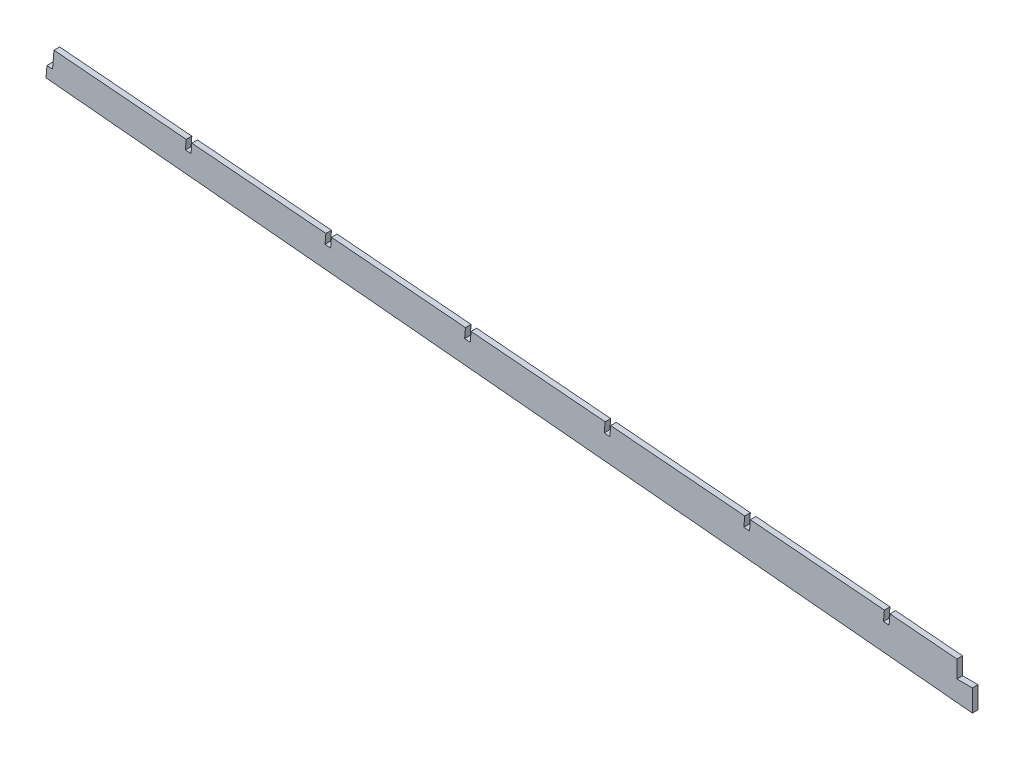
ISO-10303-21;
HEADER;
FILE_DESCRIPTION(('STEP AP214'),'2;1');
FILE_NAME('part.step','',(''),(''),'','','');
FILE_SCHEMA(('AUTOMOTIVE_DESIGN { 1 0 10303 214 1 1 1 1 }'));
ENDSEC;
DATA;
#1=APPLICATION_CONTEXT('core data for automotive mechanical design processes');
#2=APPLICATION_PROTOCOL_DEFINITION('international standard','automotive_design',2000,#1);
#3=PRODUCT_CONTEXT('',#1,'mechanical');
#4=PRODUCT('Part','Part','',(#3));
#5=PRODUCT_RELATED_PRODUCT_CATEGORY('part','',(#4));
#6=PRODUCT_DEFINITION_FORMATION('','',#4);
#7=PRODUCT_DEFINITION_CONTEXT('part definition',#1,'design');
#8=PRODUCT_DEFINITION('design','',#6,#7);
#9=PRODUCT_DEFINITION_SHAPE('','',#8);
#10=(LENGTH_UNIT() NAMED_UNIT(*) SI_UNIT(.MILLI.,.METRE.));
#11=(NAMED_UNIT(*) PLANE_ANGLE_UNIT() SI_UNIT($,.RADIAN.));
#12=(NAMED_UNIT(*) SI_UNIT($,.STERADIAN.) SOLID_ANGLE_UNIT());
#13=UNCERTAINTY_MEASURE_WITH_UNIT(LENGTH_MEASURE(1.E-05),#10,'distance_accuracy_value','');
#14=(GEOMETRIC_REPRESENTATION_CONTEXT(3) GLOBAL_UNCERTAINTY_ASSIGNED_CONTEXT((#13)) GLOBAL_UNIT_ASSIGNED_CONTEXT((#10,
#11,#12)) REPRESENTATION_CONTEXT('',''));
#15=CARTESIAN_POINT('',(0.,0.,0.));
#16=DIRECTION('',(0.,0.,1.));
#17=DIRECTION('',(1.,0.,0.));
#18=AXIS2_PLACEMENT_3D('',#15,#16,#17);
#19=CARTESIAN_POINT('',(-0.0318534873323505,-0.379333063626216,3.175));
#20=DIRECTION('',(-0.0836778433323156,-0.996492859249504,0.));
#21=DIRECTION('',(0.996492859249504,-0.0836778433323156,0.));
#22=AXIS2_PLACEMENT_3D('',#19,#20,#21);
#23=PLANE('',#22);
#24=DIRECTION('',(0.,0.,1.));
#25=VECTOR('',#24,1.);
#26=CARTESIAN_POINT('',(-435.836990415104,36.2162467569108,-4.445));
#27=LINE('',#26,#25);
#28=CARTESIAN_POINT('',(-435.836990415104,36.2162467569108,0.));
#29=VERTEX_POINT('',#28);
#30=CARTESIAN_POINT('',(-435.836990415104,36.2162467569108,3.175));
#31=VERTEX_POINT('',#30);
#32=EDGE_CURVE('E282',#29,#31,#27,.T.);
#33=ORIENTED_EDGE('',*,*,#32,.F.);
#34=DIRECTION('',(-0.996492859249504,0.0836778433323156,0.));
#35=VECTOR('',#34,1.);
#36=CARTESIAN_POINT('',(-0.0318534873323505,-0.379333063626216,0.));
#37=LINE('',#36,#35);
#38=CARTESIAN_POINT('',(-473.740091055947,39.3990590448204,0.));
#39=VERTEX_POINT('',#38);
#40=EDGE_CURVE('E530',#29,#39,#37,.T.);
#41=ORIENTED_EDGE('',*,*,#40,.T.);
#42=DIRECTION('',(0.,0.,1.));
#43=VECTOR('',#42,1.);
#44=CARTESIAN_POINT('',(-473.740091055947,39.3990590448204,0.));
#45=LINE('',#44,#43);
#46=CARTESIAN_POINT('',(-473.740091055947,39.3990590448204,3.175));
#47=VERTEX_POINT('',#46);
#48=EDGE_CURVE('E492',#39,#47,#45,.T.);
#49=ORIENTED_EDGE('',*,*,#48,.T.);
#50=DIRECTION('',(-0.996492859249504,0.0836778433323156,0.));
#51=VECTOR('',#50,1.);
#52=CARTESIAN_POINT('',(-0.0318534873323505,-0.379333063626216,3.175));
#53=LINE('',#52,#51);
#54=EDGE_CURVE('E510',#31,#47,#53,.T.);
#55=ORIENTED_EDGE('',*,*,#54,.F.);
#56=EDGE_LOOP('',(#33,#41,#49,#55));
#57=FACE_BOUND('',#56,.T.);
#58=ADVANCED_FACE('F44',(#57),#23,.F.);
#59=DIRECTION('',(0.,0.,1.));
#60=VECTOR('',#59,1.);
#61=CARTESIAN_POINT('',(-868.590421604971,72.5555676868171,0.));
#62=LINE('',#61,#60);
#63=CARTESIAN_POINT('',(-868.590421604971,72.5555676868171,0.));
#64=VERTEX_POINT('',#63);
#65=CARTESIAN_POINT('',(-868.590421604971,72.5555676868171,3.175));
#66=VERTEX_POINT('',#65);
#67=EDGE_CURVE('E313',#64,#66,#62,.T.);
#68=ORIENTED_EDGE('',*,*,#67,.T.);
#69=CARTESIAN_POINT('',(-792.784220323284,66.1899431109979,3.175));
#70=VERTEX_POINT('',#69);
#71=EDGE_CURVE('E599',#70,#66,#53,.T.);
#72=ORIENTED_EDGE('',*,*,#71,.F.);
#73=DIRECTION('',(0.,0.,1.));
#74=VECTOR('',#73,1.);
#75=CARTESIAN_POINT('',(-792.784220323284,66.1899431109979,0.));
#76=LINE('',#75,#74);
#77=CARTESIAN_POINT('',(-792.784220323284,66.1899431109979,0.));
#78=VERTEX_POINT('',#77);
#79=EDGE_CURVE('E351',#78,#70,#76,.T.);
#80=ORIENTED_EDGE('',*,*,#79,.F.);
#81=EDGE_CURVE('E633',#78,#64,#37,.T.);
#82=ORIENTED_EDGE('',*,*,#81,.T.);
#83=EDGE_LOOP('',(#68,#72,#80,#82));
#84=FACE_BOUND('',#83,.T.);
#85=ADVANCED_FACE('F710',(#84),#23,.F.);
#86=DIRECTION('',(0.,0.,1.));
#87=VECTOR('',#86,1.);
#88=CARTESIAN_POINT('',(-789.620355495167,65.9242659584178,0.));
#89=LINE('',#88,#87);
#90=CARTESIAN_POINT('',(-789.620355495167,65.9242659584178,0.));
#91=VERTEX_POINT('',#90);
#92=CARTESIAN_POINT('',(-789.620355495167,65.9242659584178,3.175));
#93=VERTEX_POINT('',#92);
#94=EDGE_CURVE('E354',#91,#93,#89,.T.);
#95=ORIENTED_EDGE('',*,*,#94,.T.);
#96=CARTESIAN_POINT('',(-713.814154213479,59.5586413825986,3.175));
#97=VERTEX_POINT('',#96);
#98=EDGE_CURVE('E593',#97,#93,#53,.T.);
#99=ORIENTED_EDGE('',*,*,#98,.F.);
#100=DIRECTION('',(0.,0.,1.));
#101=VECTOR('',#100,1.);
#102=CARTESIAN_POINT('',(-713.814154213479,59.5586413825986,0.));
#103=LINE('',#102,#101);
#104=CARTESIAN_POINT('',(-713.814154213479,59.5586413825986,0.));
#105=VERTEX_POINT('',#104);
#106=EDGE_CURVE('E386',#105,#97,#103,.T.);
#107=ORIENTED_EDGE('',*,*,#106,.F.);
#108=EDGE_CURVE('E637',#105,#91,#37,.T.);
#109=ORIENTED_EDGE('',*,*,#108,.T.);
#110=EDGE_LOOP('',(#95,#99,#107,#109));
#111=FACE_BOUND('',#110,.T.);
#112=ADVANCED_FACE('F698',(#111),#23,.F.);
#113=DIRECTION('',(0.,0.,1.));
#114=VECTOR('',#113,1.);
#115=CARTESIAN_POINT('',(-710.650289385362,59.2929642300185,0.));
#116=LINE('',#115,#114);
#117=CARTESIAN_POINT('',(-710.650289385362,59.2929642300185,0.));
#118=VERTEX_POINT('',#117);
#119=CARTESIAN_POINT('',(-710.650289385362,59.2929642300185,3.175));
#120=VERTEX_POINT('',#119);
#121=EDGE_CURVE('E389',#118,#120,#116,.T.);
#122=ORIENTED_EDGE('',*,*,#121,.T.);
#123=CARTESIAN_POINT('',(-634.844088103674,52.9273396541992,3.175));
#124=VERTEX_POINT('',#123);
#125=EDGE_CURVE('E587',#124,#120,#53,.T.);
#126=ORIENTED_EDGE('',*,*,#125,.F.);
#127=DIRECTION('',(0.,0.,1.));
#128=VECTOR('',#127,1.);
#129=CARTESIAN_POINT('',(-634.844088103674,52.9273396541992,0.));
#130=LINE('',#129,#128);
#131=CARTESIAN_POINT('',(-634.844088103674,52.9273396541992,0.));
#132=VERTEX_POINT('',#131);
#133=EDGE_CURVE('E421',#132,#124,#130,.T.);
#134=ORIENTED_EDGE('',*,*,#133,.F.);
#135=EDGE_CURVE('E644',#132,#118,#37,.T.);
#136=ORIENTED_EDGE('',*,*,#135,.T.);
#137=EDGE_LOOP('',(#122,#126,#134,#136));
#138=FACE_BOUND('',#137,.T.);
#139=ADVANCED_FACE('F686',(#138),#23,.F.);
#140=DIRECTION('',(0.,0.,1.));
#141=VECTOR('',#140,1.);
#142=CARTESIAN_POINT('',(-631.680223275557,52.6616625016191,0.));
#143=LINE('',#142,#141);
#144=CARTESIAN_POINT('',(-631.680223275557,52.6616625016191,0.));
#145=VERTEX_POINT('',#144);
#146=CARTESIAN_POINT('',(-631.680223275557,52.6616625016191,3.175));
#147=VERTEX_POINT('',#146);
#148=EDGE_CURVE('E424',#145,#147,#143,.T.);
#149=ORIENTED_EDGE('',*,*,#148,.T.);
#150=CARTESIAN_POINT('',(-555.874021993869,46.2960379257999,3.175));
#151=VERTEX_POINT('',#150);
#152=EDGE_CURVE('E583',#151,#147,#53,.T.);
#153=ORIENTED_EDGE('',*,*,#152,.F.);
#154=DIRECTION('',(0.,0.,1.));
#155=VECTOR('',#154,1.);
#156=CARTESIAN_POINT('',(-555.874021993869,46.2960379257999,0.));
#157=LINE('',#156,#155);
#158=CARTESIAN_POINT('',(-555.874021993869,46.2960379257999,0.));
#159=VERTEX_POINT('',#158);
#160=EDGE_CURVE('E456',#159,#151,#157,.T.);
#161=ORIENTED_EDGE('',*,*,#160,.F.);
#162=EDGE_CURVE('E651',#159,#145,#37,.T.);
#163=ORIENTED_EDGE('',*,*,#162,.T.);
#164=EDGE_LOOP('',(#149,#153,#161,#163));
#165=FACE_BOUND('',#164,.T.);
#166=ADVANCED_FACE('F674',(#165),#23,.F.);
#167=DIRECTION('',(0.,0.,1.));
#168=VECTOR('',#167,1.);
#169=CARTESIAN_POINT('',(-552.710157165752,46.0303607732198,0.));
#170=LINE('',#169,#168);
#171=CARTESIAN_POINT('',(-552.710157165752,46.0303607732198,0.));
#172=VERTEX_POINT('',#171);
#173=CARTESIAN_POINT('',(-552.710157165752,46.0303607732198,3.175));
#174=VERTEX_POINT('',#173);
#175=EDGE_CURVE('E459',#172,#174,#170,.T.);
#176=ORIENTED_EDGE('',*,*,#175,.T.);
#177=CARTESIAN_POINT('',(-476.903955884065,39.6647361974005,3.175));
#178=VERTEX_POINT('',#177);
#179=EDGE_CURVE('E514',#178,#174,#53,.T.);
#180=ORIENTED_EDGE('',*,*,#179,.F.);
#181=DIRECTION('',(0.,0.,1.));
#182=VECTOR('',#181,1.);
#183=CARTESIAN_POINT('',(-476.903955884065,39.6647361974005,0.));
#184=LINE('',#183,#182);
#185=CARTESIAN_POINT('',(-476.903955884065,39.6647361974005,0.));
#186=VERTEX_POINT('',#185);
#187=EDGE_CURVE('E489',#186,#178,#184,.T.);
#188=ORIENTED_EDGE('',*,*,#187,.F.);
#189=EDGE_CURVE('E533',#186,#172,#37,.T.);
#190=ORIENTED_EDGE('',*,*,#189,.T.);
#191=EDGE_LOOP('',(#176,#180,#188,#190));
#192=FACE_BOUND('',#191,.T.);
#193=ADVANCED_FACE('F579',(#192),#23,.F.);
#194=CARTESIAN_POINT('',(0.,0.,3.175));
#195=DIRECTION('',(0.,0.,1.));
#196=DIRECTION('',(1.,0.,0.));
#197=AXIS2_PLACEMENT_3D('',#194,#195,#196);
#198=PLANE('',#197);
#199=DIRECTION('',(0.,-1.,0.));
#200=VECTOR('',#199,1.);
#201=CARTESIAN_POINT('',(-427.115588921084,26.4516197265587,3.175));
#202=LINE('',#201,#200);
#203=CARTESIAN_POINT('',(-427.115588921084,26.4516197265587,3.175));
#204=VERTEX_POINT('',#203);
#205=CARTESIAN_POINT('',(-427.115588921078,14.108196168973,3.175));
#206=VERTEX_POINT('',#205);
#207=EDGE_CURVE('E60',#204,#206,#202,.T.);
#208=ORIENTED_EDGE('',*,*,#207,.F.);
#209=DIRECTION('',(1.,0.,0.));
#210=VECTOR('',#209,1.);
#211=CARTESIAN_POINT('',(-435.836990415104,26.4516197265587,3.175));
#212=LINE('',#211,#210);
#213=CARTESIAN_POINT('',(-435.836990415104,26.4516197265587,3.175));
#214=VERTEX_POINT('',#213);
#215=EDGE_CURVE('E262',#214,#204,#212,.T.);
#216=ORIENTED_EDGE('',*,*,#215,.F.);
#217=DIRECTION('',(0.,-1.,0.));
#218=VECTOR('',#217,1.);
#219=CARTESIAN_POINT('',(-435.836990415104,36.2162467569108,3.175));
#220=LINE('',#219,#218);
#221=EDGE_CURVE('E269',#31,#214,#220,.T.);
#222=ORIENTED_EDGE('',*,*,#221,.F.);
#223=ORIENTED_EDGE('',*,*,#54,.T.);
#224=DIRECTION('',(-0.0836778433323161,-0.996492859249504,0.));
#225=VECTOR('',#224,1.);
#226=CARTESIAN_POINT('',(-473.708237568615,39.7783921084469,3.175));
#227=LINE('',#226,#225);
#228=CARTESIAN_POINT('',(-474.231125379992,33.5514872376235,3.175));
#229=VERTEX_POINT('',#228);
#230=EDGE_CURVE('E480',#47,#229,#227,.T.);
#231=ORIENTED_EDGE('',*,*,#230,.T.);
#232=DIRECTION('',(-0.996405796065059,0.0847082615094664,0.));
#233=VECTOR('',#232,1.);
#234=CARTESIAN_POINT('',(-0.570967382438097,-6.71617147002641,3.175));
#235=LINE('',#234,#233);
#236=CARTESIAN_POINT('',(-477.394715473978,33.8204361117152,3.175));
#237=VERTEX_POINT('',#236);
#238=EDGE_CURVE('E289',#229,#237,#235,.T.);
#239=ORIENTED_EDGE('',*,*,#238,.T.);
#240=DIRECTION('',(-0.0836778433323169,-0.996492859249504,0.));
#241=VECTOR('',#240,1.);
#242=CARTESIAN_POINT('',(-476.872102396732,40.0440692610274,3.175));
#243=LINE('',#242,#241);
#244=EDGE_CURVE('E469',#178,#237,#243,.T.);
#245=ORIENTED_EDGE('',*,*,#244,.F.);
#246=ORIENTED_EDGE('',*,*,#179,.T.);
#247=DIRECTION('',(-0.0836778433323159,-0.996492859249504,0.));
#248=VECTOR('',#247,1.);
#249=CARTESIAN_POINT('',(-552.67830367842,46.4096938368461,3.175));
#250=LINE('',#249,#248);
#251=CARTESIAN_POINT('',(-553.194334125879,40.2644511349515,3.175));
#252=VERTEX_POINT('',#251);
#253=EDGE_CURVE('E446',#174,#252,#250,.T.);
#254=ORIENTED_EDGE('',*,*,#253,.T.);
#255=DIRECTION('',(-0.996405796065059,0.0847082615094664,0.));
#256=VECTOR('',#255,1.);
#257=CARTESIAN_POINT('',(-0.570967382438097,-6.71617147002641,3.175));
#258=LINE('',#257,#256);
#259=CARTESIAN_POINT('',(-556.357924219865,40.5334000090432,3.175));
#260=VERTEX_POINT('',#259);
#261=EDGE_CURVE('E442',#252,#260,#258,.T.);
#262=ORIENTED_EDGE('',*,*,#261,.T.);
#263=DIRECTION('',(-0.0836778433323176,-0.996492859249504,0.));
#264=VECTOR('',#263,1.);
#265=CARTESIAN_POINT('',(-555.842168506537,46.6753709894272,3.175));
#266=LINE('',#265,#264);
#267=EDGE_CURVE('E434',#151,#260,#266,.T.);
#268=ORIENTED_EDGE('',*,*,#267,.F.);
#269=ORIENTED_EDGE('',*,*,#152,.T.);
#270=DIRECTION('',(-0.0836778433323144,-0.996492859249504,0.));
#271=VECTOR('',#270,1.);
#272=CARTESIAN_POINT('',(-631.648369788225,53.0409955652446,3.175));
#273=LINE('',#272,#271);
#274=CARTESIAN_POINT('',(-632.157542871765,46.9774150322796,3.175));
#275=VERTEX_POINT('',#274);
#276=EDGE_CURVE('E411',#147,#275,#273,.T.);
#277=ORIENTED_EDGE('',*,*,#276,.T.);
#278=DIRECTION('',(-0.996405796065059,0.0847082615094664,0.));
#279=VECTOR('',#278,1.);
#280=CARTESIAN_POINT('',(-0.570967382438097,-6.71617147002641,3.175));
#281=LINE('',#280,#279);
#282=CARTESIAN_POINT('',(-635.321132965751,47.2463639063712,3.175));
#283=VERTEX_POINT('',#282);
#284=EDGE_CURVE('E407',#275,#283,#281,.T.);
#285=ORIENTED_EDGE('',*,*,#284,.T.);
#286=DIRECTION('',(-0.0836778433323144,-0.996492859249504,0.));
#287=VECTOR('',#286,1.);
#288=CARTESIAN_POINT('',(-634.812234616342,53.3066727178247,3.175));
#289=LINE('',#288,#287);
#290=EDGE_CURVE('E399',#124,#283,#289,.T.);
#291=ORIENTED_EDGE('',*,*,#290,.F.);
#292=ORIENTED_EDGE('',*,*,#125,.T.);
#293=DIRECTION('',(-0.0836778433323128,-0.996492859249505,0.));
#294=VECTOR('',#293,1.);
#295=CARTESIAN_POINT('',(-710.61843589803,59.6722972936427,3.175));
#296=LINE('',#295,#294);
#297=CARTESIAN_POINT('',(-711.120751617652,53.6903789296076,3.175));
#298=VERTEX_POINT('',#297);
#299=EDGE_CURVE('E376',#120,#298,#296,.T.);
#300=ORIENTED_EDGE('',*,*,#299,.T.);
#301=DIRECTION('',(-0.996405796065059,0.0847082615094664,0.));
#302=VECTOR('',#301,1.);
#303=CARTESIAN_POINT('',(-0.570967382438097,-6.71617147002641,3.175));
#304=LINE('',#303,#302);
#305=CARTESIAN_POINT('',(-714.284341711638,53.9593278036993,3.175));
#306=VERTEX_POINT('',#305);
#307=EDGE_CURVE('E372',#298,#306,#304,.T.);
#308=ORIENTED_EDGE('',*,*,#307,.T.);
#309=DIRECTION('',(-0.0836778433323147,-0.996492859249504,0.));
#310=VECTOR('',#309,1.);
#311=CARTESIAN_POINT('',(-713.782300726147,59.9379744462242,3.175));
#312=LINE('',#311,#310);
#313=EDGE_CURVE('E364',#97,#306,#312,.T.);
#314=ORIENTED_EDGE('',*,*,#313,.F.);
#315=ORIENTED_EDGE('',*,*,#98,.T.);
#316=DIRECTION('',(-0.0836778433323151,-0.996492859249504,0.));
#317=VECTOR('',#316,1.);
#318=CARTESIAN_POINT('',(-789.588502007834,66.3035990220436,3.175));
#319=LINE('',#318,#317);
#320=CARTESIAN_POINT('',(-790.083960363538,60.4033428269356,3.175));
#321=VERTEX_POINT('',#320);
#322=EDGE_CURVE('E341',#93,#321,#319,.T.);
#323=ORIENTED_EDGE('',*,*,#322,.T.);
#324=DIRECTION('',(-0.996405796065059,0.0847082615094664,0.));
#325=VECTOR('',#324,1.);
#326=CARTESIAN_POINT('',(-0.570967382438097,-6.71617147002641,3.175));
#327=LINE('',#326,#325);
#328=CARTESIAN_POINT('',(-793.247550457524,60.6722917010273,3.175));
#329=VERTEX_POINT('',#328);
#330=EDGE_CURVE('E337',#321,#329,#327,.T.);
#331=ORIENTED_EDGE('',*,*,#330,.T.);
#332=DIRECTION('',(-0.0836778433323151,-0.996492859249504,0.));
#333=VECTOR('',#332,1.);
#334=CARTESIAN_POINT('',(-792.752366835951,66.5692761746238,3.175));
#335=LINE('',#334,#333);
#336=EDGE_CURVE('E329',#70,#329,#335,.T.);
#337=ORIENTED_EDGE('',*,*,#336,.F.);
#338=ORIENTED_EDGE('',*,*,#71,.T.);
#339=DIRECTION('',(-0.083677843332317,-0.996492859249504,0.));
#340=VECTOR('',#339,1.);
#341=CARTESIAN_POINT('',(-868.558568117639,72.9349007504446,3.175));
#342=LINE('',#341,#340);
#343=CARTESIAN_POINT('',(-869.047169109425,67.1163067242637,3.175));
#344=VERTEX_POINT('',#343);
#345=EDGE_CURVE('E295',#66,#344,#342,.T.);
#346=ORIENTED_EDGE('',*,*,#345,.T.);
#347=DIRECTION('',(-0.996405796065059,0.0847082615094664,0.));
#348=VECTOR('',#347,1.);
#349=CARTESIAN_POINT('',(-0.570967382438097,-6.71617147002641,3.175));
#350=LINE('',#349,#348);
#351=CARTESIAN_POINT('',(-872.21075920341,67.3852555983553,3.175));
#352=VERTEX_POINT('',#351);
#353=EDGE_CURVE('E305',#344,#352,#350,.T.);
#354=ORIENTED_EDGE('',*,*,#353,.T.);
#355=DIRECTION('',(-0.0836778433323125,-0.996492859249505,0.));
#356=VECTOR('',#355,1.);
#357=CARTESIAN_POINT('',(-871.722432945756,73.2005779030208,3.175));
#358=LINE('',#357,#356);
#359=CARTESIAN_POINT('',(-871.754286433088,72.8212448393973,3.175));
#360=VERTEX_POINT('',#359);
#361=EDGE_CURVE('E302',#360,#352,#358,.T.);
#362=ORIENTED_EDGE('',*,*,#361,.F.);
#363=CARTESIAN_POINT('',(-946.548050969778,79.1018527263909,3.175));
#364=VERTEX_POINT('',#363);
#365=EDGE_CURVE('E509',#360,#364,#53,.T.);
#366=ORIENTED_EDGE('',*,*,#365,.T.);
#367=DIRECTION('',(-0.0836778433323184,-0.996492859249504,0.));
#368=VECTOR('',#367,1.);
#369=CARTESIAN_POINT('',(-946.516197482445,79.4811857900198,3.175));
#370=LINE('',#369,#368);
#371=CARTESIAN_POINT('',(-947.36663083099,69.3536451490996,3.175));
#372=VERTEX_POINT('',#371);
#373=EDGE_CURVE('E513',#364,#372,#370,.T.);
#374=ORIENTED_EDGE('',*,*,#373,.T.);
#375=DIRECTION('',(0.996492859249504,-0.0836778433323209,0.));
#376=VECTOR('',#375,1.);
#377=CARTESIAN_POINT('',(-0.850433348545088,-10.1275406409225,3.175));
#378=LINE('',#377,#376);
#379=CARTESIAN_POINT('',(-950.530495659107,69.6193223016797,3.175));
#380=VERTEX_POINT('',#379);
#381=EDGE_CURVE('E498',#380,#372,#378,.T.);
#382=ORIENTED_EDGE('',*,*,#381,.F.);
#383=DIRECTION('',(0.0836778433323086,0.996492859249505,0.));
#384=VECTOR('',#383,1.);
#385=CARTESIAN_POINT('',(-949.680062310563,79.7468629425905,3.175));
#386=LINE('',#385,#384);
#387=CARTESIAN_POINT('',(-951.061849964267,63.2915926454454,3.175));
#388=VERTEX_POINT('',#387);
#389=EDGE_CURVE('E502',#388,#380,#386,.T.);
#390=ORIENTED_EDGE('',*,*,#389,.F.);
#391=DIRECTION('',(0.995623016654997,-0.0934601985168241,0.));
#392=VECTOR('',#391,1.);
#393=CARTESIAN_POINT('',(-2.41798944271638,-25.7586221878595,3.175));
#394=LINE('',#393,#392);
#395=EDGE_CURVE('E275',#388,#206,#394,.T.);
#396=ORIENTED_EDGE('',*,*,#395,.T.);
#397=EDGE_LOOP('',(#208,#216,#222,#223,#231,#239,#245,#246,#254,#262,#268,#269,#277,#285,#291,
#292,#300,#308,#314,#315,#323,#331,#337,#338,#346,#354,#362,#366,#374,#382,#390,#396));
#398=FACE_BOUND('',#397,.T.);
#399=ADVANCED_FACE('F272',(#398),#198,.T.);
#400=CARTESIAN_POINT('',(0.,0.,0.));
#401=DIRECTION('',(0.,0.,1.));
#402=DIRECTION('',(1.,0.,0.));
#403=AXIS2_PLACEMENT_3D('',#400,#401,#402);
#404=PLANE('',#403);
#405=DIRECTION('',(1.,0.,0.));
#406=VECTOR('',#405,1.);
#407=CARTESIAN_POINT('',(0.,26.4516197265587,0.));
#408=LINE('',#407,#406);
#409=CARTESIAN_POINT('',(-435.836990415104,26.4516197265587,0.));
#410=VERTEX_POINT('',#409);
#411=CARTESIAN_POINT('',(-427.115588921084,26.4516197265587,0.));
#412=VERTEX_POINT('',#411);
#413=EDGE_CURVE('E11',#410,#412,#408,.T.);
#414=ORIENTED_EDGE('',*,*,#413,.T.);
#415=DIRECTION('',(0.,-1.,0.));
#416=VECTOR('',#415,1.);
#417=CARTESIAN_POINT('',(-427.115588921084,-1.92083484287925E-12,0.));
#418=LINE('',#417,#416);
#419=CARTESIAN_POINT('',(-427.115588921084,14.1081961689735,0.));
#420=VERTEX_POINT('',#419);
#421=EDGE_CURVE('E256',#412,#420,#418,.T.);
#422=ORIENTED_EDGE('',*,*,#421,.T.);
#423=DIRECTION('',(0.995623016654997,-0.0934601985168241,0.));
#424=VECTOR('',#423,1.);
#425=CARTESIAN_POINT('',(-2.41798944271638,-25.7586221878595,0.));
#426=LINE('',#425,#424);
#427=CARTESIAN_POINT('',(-951.061849964267,63.2915926454454,0.));
#428=VERTEX_POINT('',#427);
#429=EDGE_CURVE('E525',#428,#420,#426,.T.);
#430=ORIENTED_EDGE('',*,*,#429,.F.);
#431=DIRECTION('',(0.0836778433323086,0.996492859249505,0.));
#432=VECTOR('',#431,1.);
#433=CARTESIAN_POINT('',(-949.680062310563,79.7468629425905,0.));
#434=LINE('',#433,#432);
#435=CARTESIAN_POINT('',(-950.530495659107,69.6193223016797,0.));
#436=VERTEX_POINT('',#435);
#437=EDGE_CURVE('E521',#428,#436,#434,.T.);
#438=ORIENTED_EDGE('',*,*,#437,.T.);
#439=DIRECTION('',(0.996492859249504,-0.0836778433323209,0.));
#440=VECTOR('',#439,1.);
#441=CARTESIAN_POINT('',(-0.850433348545088,-10.1275406409225,0.));
#442=LINE('',#441,#440);
#443=CARTESIAN_POINT('',(-947.36663083099,69.3536451490996,0.));
#444=VERTEX_POINT('',#443);
#445=EDGE_CURVE('E317',#436,#444,#442,.T.);
#446=ORIENTED_EDGE('',*,*,#445,.T.);
#447=DIRECTION('',(-0.0836778433323184,-0.996492859249504,0.));
#448=VECTOR('',#447,1.);
#449=CARTESIAN_POINT('',(-946.516197482445,79.4811857900198,0.));
#450=LINE('',#449,#448);
#451=CARTESIAN_POINT('',(-946.548050969778,79.1018527263909,0.));
#452=VERTEX_POINT('',#451);
#453=EDGE_CURVE('E503',#452,#444,#450,.T.);
#454=ORIENTED_EDGE('',*,*,#453,.F.);
#455=CARTESIAN_POINT('',(-871.754286433088,72.8212448393973,0.));
#456=VERTEX_POINT('',#455);
#457=EDGE_CURVE('E529',#456,#452,#37,.T.);
#458=ORIENTED_EDGE('',*,*,#457,.F.);
#459=DIRECTION('',(-0.0836778433323125,-0.996492859249505,0.));
#460=VECTOR('',#459,1.);
#461=CARTESIAN_POINT('',(-871.722432945756,73.2005779030208,0.));
#462=LINE('',#461,#460);
#463=CARTESIAN_POINT('',(-872.210759203411,67.3852555983553,0.));
#464=VERTEX_POINT('',#463);
#465=EDGE_CURVE('E290',#456,#464,#462,.T.);
#466=ORIENTED_EDGE('',*,*,#465,.T.);
#467=DIRECTION('',(-0.996405796065059,0.0847082615094664,0.));
#468=VECTOR('',#467,1.);
#469=CARTESIAN_POINT('',(-0.570967382438097,-6.71617147002641,0.));
#470=LINE('',#469,#468);
#471=CARTESIAN_POINT('',(-869.047169109425,67.1163067242637,0.));
#472=VERTEX_POINT('',#471);
#473=EDGE_CURVE('E294',#472,#464,#470,.T.);
#474=ORIENTED_EDGE('',*,*,#473,.F.);
#475=DIRECTION('',(-0.083677843332317,-0.996492859249504,0.));
#476=VECTOR('',#475,1.);
#477=CARTESIAN_POINT('',(-868.558568117639,72.9349007504446,0.));
#478=LINE('',#477,#476);
#479=EDGE_CURVE('E298',#64,#472,#478,.T.);
#480=ORIENTED_EDGE('',*,*,#479,.F.);
#481=ORIENTED_EDGE('',*,*,#81,.F.);
#482=DIRECTION('',(-0.0836778433323151,-0.996492859249504,0.));
#483=VECTOR('',#482,1.);
#484=CARTESIAN_POINT('',(-792.752366835951,66.5692761746238,0.));
#485=LINE('',#484,#483);
#486=CARTESIAN_POINT('',(-793.247550457524,60.6722917010273,0.));
#487=VERTEX_POINT('',#486);
#488=EDGE_CURVE('E332',#78,#487,#485,.T.);
#489=ORIENTED_EDGE('',*,*,#488,.T.);
#490=DIRECTION('',(-0.996405796065059,0.0847082615094664,0.));
#491=VECTOR('',#490,1.);
#492=CARTESIAN_POINT('',(-0.570967382438097,-6.71617147002641,0.));
#493=LINE('',#492,#491);
#494=CARTESIAN_POINT('',(-790.083960363538,60.4033428269356,0.));
#495=VERTEX_POINT('',#494);
#496=EDGE_CURVE('E325',#495,#487,#493,.T.);
#497=ORIENTED_EDGE('',*,*,#496,.F.);
#498=DIRECTION('',(-0.0836778433323151,-0.996492859249504,0.));
#499=VECTOR('',#498,1.);
#500=CARTESIAN_POINT('',(-789.588502007834,66.3035990220436,0.));
#501=LINE('',#500,#499);
#502=EDGE_CURVE('E328',#91,#495,#501,.T.);
#503=ORIENTED_EDGE('',*,*,#502,.F.);
#504=ORIENTED_EDGE('',*,*,#108,.F.);
#505=DIRECTION('',(-0.0836778433323147,-0.996492859249504,0.));
#506=VECTOR('',#505,1.);
#507=CARTESIAN_POINT('',(-713.782300726147,59.9379744462242,0.));
#508=LINE('',#507,#506);
#509=CARTESIAN_POINT('',(-714.284341711638,53.9593278036993,0.));
#510=VERTEX_POINT('',#509);
#511=EDGE_CURVE('E367',#105,#510,#508,.T.);
#512=ORIENTED_EDGE('',*,*,#511,.T.);
#513=DIRECTION('',(-0.996405796065059,0.0847082615094664,0.));
#514=VECTOR('',#513,1.);
#515=CARTESIAN_POINT('',(-0.570967382438097,-6.71617147002641,0.));
#516=LINE('',#515,#514);
#517=CARTESIAN_POINT('',(-711.120751617652,53.6903789296076,0.));
#518=VERTEX_POINT('',#517);
#519=EDGE_CURVE('E360',#518,#510,#516,.T.);
#520=ORIENTED_EDGE('',*,*,#519,.F.);
#521=DIRECTION('',(-0.0836778433323128,-0.996492859249505,0.));
#522=VECTOR('',#521,1.);
#523=CARTESIAN_POINT('',(-710.61843589803,59.6722972936427,0.));
#524=LINE('',#523,#522);
#525=EDGE_CURVE('E363',#118,#518,#524,.T.);
#526=ORIENTED_EDGE('',*,*,#525,.F.);
#527=ORIENTED_EDGE('',*,*,#135,.F.);
#528=DIRECTION('',(-0.0836778433323144,-0.996492859249504,0.));
#529=VECTOR('',#528,1.);
#530=CARTESIAN_POINT('',(-634.812234616342,53.3066727178247,0.));
#531=LINE('',#530,#529);
#532=CARTESIAN_POINT('',(-635.321132965751,47.2463639063712,0.));
#533=VERTEX_POINT('',#532);
#534=EDGE_CURVE('E402',#132,#533,#531,.T.);
#535=ORIENTED_EDGE('',*,*,#534,.T.);
#536=DIRECTION('',(-0.996405796065059,0.0847082615094664,0.));
#537=VECTOR('',#536,1.);
#538=CARTESIAN_POINT('',(-0.570967382438097,-6.71617147002641,0.));
#539=LINE('',#538,#537);
#540=CARTESIAN_POINT('',(-632.157542871765,46.9774150322796,0.));
#541=VERTEX_POINT('',#540);
#542=EDGE_CURVE('E395',#541,#533,#539,.T.);
#543=ORIENTED_EDGE('',*,*,#542,.F.);
#544=DIRECTION('',(-0.0836778433323144,-0.996492859249504,0.));
#545=VECTOR('',#544,1.);
#546=CARTESIAN_POINT('',(-631.648369788225,53.0409955652446,0.));
#547=LINE('',#546,#545);
#548=EDGE_CURVE('E398',#145,#541,#547,.T.);
#549=ORIENTED_EDGE('',*,*,#548,.F.);
#550=ORIENTED_EDGE('',*,*,#162,.F.);
#551=DIRECTION('',(-0.0836778433323176,-0.996492859249504,0.));
#552=VECTOR('',#551,1.);
#553=CARTESIAN_POINT('',(-555.842168506537,46.6753709894272,0.));
#554=LINE('',#553,#552);
#555=CARTESIAN_POINT('',(-556.357924219865,40.5334000090432,0.));
#556=VERTEX_POINT('',#555);
#557=EDGE_CURVE('E437',#159,#556,#554,.T.);
#558=ORIENTED_EDGE('',*,*,#557,.T.);
#559=DIRECTION('',(-0.996405796065059,0.0847082615094664,0.));
#560=VECTOR('',#559,1.);
#561=CARTESIAN_POINT('',(-0.570967382438097,-6.71617147002641,0.));
#562=LINE('',#561,#560);
#563=CARTESIAN_POINT('',(-553.194334125879,40.2644511349515,0.));
#564=VERTEX_POINT('',#563);
#565=EDGE_CURVE('E430',#564,#556,#562,.T.);
#566=ORIENTED_EDGE('',*,*,#565,.F.);
#567=DIRECTION('',(-0.0836778433323159,-0.996492859249504,0.));
#568=VECTOR('',#567,1.);
#569=CARTESIAN_POINT('',(-552.67830367842,46.4096938368461,0.));
#570=LINE('',#569,#568);
#571=EDGE_CURVE('E433',#172,#564,#570,.T.);
#572=ORIENTED_EDGE('',*,*,#571,.F.);
#573=ORIENTED_EDGE('',*,*,#189,.F.);
#574=DIRECTION('',(-0.0836778433323169,-0.996492859249504,0.));
#575=VECTOR('',#574,1.);
#576=CARTESIAN_POINT('',(-476.872102396732,40.0440692610274,0.));
#577=LINE('',#576,#575);
#578=CARTESIAN_POINT('',(-477.394715473978,33.8204361117152,0.));
#579=VERTEX_POINT('',#578);
#580=EDGE_CURVE('E472',#186,#579,#577,.T.);
#581=ORIENTED_EDGE('',*,*,#580,.T.);
#582=DIRECTION('',(-0.996405796065059,0.0847082615094664,0.));
#583=VECTOR('',#582,1.);
#584=CARTESIAN_POINT('',(-0.570967382438097,-6.71617147002641,0.));
#585=LINE('',#584,#583);
#586=CARTESIAN_POINT('',(-474.231125379992,33.5514872376235,0.));
#587=VERTEX_POINT('',#586);
#588=EDGE_CURVE('E465',#587,#579,#585,.T.);
#589=ORIENTED_EDGE('',*,*,#588,.F.);
#590=DIRECTION('',(-0.0836778433323161,-0.996492859249504,0.));
#591=VECTOR('',#590,1.);
#592=CARTESIAN_POINT('',(-473.708237568615,39.7783921084469,0.));
#593=LINE('',#592,#591);
#594=EDGE_CURVE('E468',#39,#587,#593,.T.);
#595=ORIENTED_EDGE('',*,*,#594,.F.);
#596=ORIENTED_EDGE('',*,*,#40,.F.);
#597=DIRECTION('',(0.,-1.,0.));
#598=VECTOR('',#597,1.);
#599=CARTESIAN_POINT('',(-435.836990415104,0.,0.));
#600=LINE('',#599,#598);
#601=EDGE_CURVE('E53',#29,#410,#600,.T.);
#602=ORIENTED_EDGE('',*,*,#601,.T.);
#603=EDGE_LOOP('',(#414,#422,#430,#438,#446,#454,#458,#466,#474,#480,#481,#489,#497,#503,#504,
#512,#520,#526,#527,#535,#543,#549,#550,#558,#566,#572,#573,#581,#589,#595,#596,#602));
#604=FACE_BOUND('',#603,.T.);
#605=ADVANCED_FACE('F556',(#604),#404,.F.);
#606=CARTESIAN_POINT('',(-0.850433348545088,-10.1275406409225,3.175));
#607=DIRECTION('',(0.0836778433323209,0.996492859249504,0.));
#608=DIRECTION('',(-0.996492859249504,0.0836778433323209,0.));
#609=AXIS2_PLACEMENT_3D('',#606,#607,#608);
#610=PLANE('',#609);
#611=ORIENTED_EDGE('',*,*,#445,.F.);
#612=DIRECTION('',(0.,0.,-1.));
#613=VECTOR('',#612,1.);
#614=CARTESIAN_POINT('',(-950.530495659107,69.6193223016797,3.175));
#615=LINE('',#614,#613);
#616=EDGE_CURVE('E546',#380,#436,#615,.T.);
#617=ORIENTED_EDGE('',*,*,#616,.F.);
#618=ORIENTED_EDGE('',*,*,#381,.T.);
#619=DIRECTION('',(0.,0.,-1.));
#620=VECTOR('',#619,1.);
#621=CARTESIAN_POINT('',(-947.36663083099,69.3536451490996,3.175));
#622=LINE('',#621,#620);
#623=EDGE_CURVE('E517',#372,#444,#622,.T.);
#624=ORIENTED_EDGE('',*,*,#623,.T.);
#625=EDGE_LOOP('',(#611,#617,#618,#624));
#626=FACE_BOUND('',#625,.T.);
#627=ADVANCED_FACE('F46',(#626),#610,.T.);
#628=CARTESIAN_POINT('',(-949.680062310563,79.7468629425905,3.175));
#629=DIRECTION('',(-0.996492859249505,0.0836778433323086,0.));
#630=DIRECTION('',(-0.0836778433323086,-0.996492859249505,0.));
#631=AXIS2_PLACEMENT_3D('',#628,#629,#630);
#632=PLANE('',#631);
#633=ORIENTED_EDGE('',*,*,#437,.F.);
#634=DIRECTION('',(0.,0.,-1.));
#635=VECTOR('',#634,1.);
#636=CARTESIAN_POINT('',(-951.061849964267,63.2915926454454,3.175));
#637=LINE('',#636,#635);
#638=EDGE_CURVE('E543',#388,#428,#637,.T.);
#639=ORIENTED_EDGE('',*,*,#638,.F.);
#640=ORIENTED_EDGE('',*,*,#389,.T.);
#641=ORIENTED_EDGE('',*,*,#616,.T.);
#642=EDGE_LOOP('',(#633,#639,#640,#641));
#643=FACE_BOUND('',#642,.T.);
#644=ADVANCED_FACE('F627',(#643),#632,.T.);
#645=CARTESIAN_POINT('',(-2.41798944271638,-25.7586221878595,3.175));
#646=DIRECTION('',(0.0934601985168241,0.995623016654997,0.));
#647=DIRECTION('',(-0.995623016654997,0.0934601985168241,0.));
#648=AXIS2_PLACEMENT_3D('',#645,#646,#647);
#649=PLANE('',#648);
#650=ORIENTED_EDGE('',*,*,#429,.T.);
#651=DIRECTION('',(0.,0.,1.));
#652=VECTOR('',#651,1.);
#653=CARTESIAN_POINT('',(-427.115588921084,14.1081961689735,3.175));
#654=LINE('',#653,#652);
#655=EDGE_CURVE('E549',#420,#206,#654,.T.);
#656=ORIENTED_EDGE('',*,*,#655,.T.);
#657=ORIENTED_EDGE('',*,*,#395,.F.);
#658=ORIENTED_EDGE('',*,*,#638,.T.);
#659=EDGE_LOOP('',(#650,#656,#657,#658));
#660=FACE_BOUND('',#659,.T.);
#661=ADVANCED_FACE('F630',(#660),#649,.F.);
#662=ORIENTED_EDGE('',*,*,#365,.F.);
#663=DIRECTION('',(0.,0.,1.));
#664=VECTOR('',#663,1.);
#665=CARTESIAN_POINT('',(-871.754286433088,72.8212448393973,0.));
#666=LINE('',#665,#664);
#667=EDGE_CURVE('E301',#456,#360,#666,.T.);
#668=ORIENTED_EDGE('',*,*,#667,.F.);
#669=ORIENTED_EDGE('',*,*,#457,.T.);
#670=DIRECTION('',(0.,0.,-1.));
#671=VECTOR('',#670,1.);
#672=CARTESIAN_POINT('',(-946.548050969778,79.1018527263909,3.175));
#673=LINE('',#672,#671);
#674=EDGE_CURVE('E539',#364,#452,#673,.T.);
#675=ORIENTED_EDGE('',*,*,#674,.F.);
#676=EDGE_LOOP('',(#662,#668,#669,#675));
#677=FACE_BOUND('',#676,.T.);
#678=ADVANCED_FACE('F618',(#677),#23,.F.);
#679=CARTESIAN_POINT('',(-946.516197482445,79.4811857900198,3.175));
#680=DIRECTION('',(0.996492859249504,-0.0836778433323184,0.));
#681=DIRECTION('',(0.0836778433323184,0.996492859249504,0.));
#682=AXIS2_PLACEMENT_3D('',#679,#680,#681);
#683=PLANE('',#682);
#684=ORIENTED_EDGE('',*,*,#453,.T.);
#685=ORIENTED_EDGE('',*,*,#623,.F.);
#686=ORIENTED_EDGE('',*,*,#373,.F.);
#687=ORIENTED_EDGE('',*,*,#674,.T.);
#688=EDGE_LOOP('',(#684,#685,#686,#687));
#689=FACE_BOUND('',#688,.T.);
#690=ADVANCED_FACE('F622',(#689),#683,.F.);
#691=CARTESIAN_POINT('',(-0.570967382438097,-6.71617147002641,0.));
#692=DIRECTION('',(0.0847082615094664,0.996405796065059,0.));
#693=DIRECTION('',(-0.996405796065059,0.0847082615094664,0.));
#694=AXIS2_PLACEMENT_3D('',#691,#692,#693);
#695=PLANE('',#694);
#696=ORIENTED_EDGE('',*,*,#238,.F.);
#697=DIRECTION('',(0.,0.,1.));
#698=VECTOR('',#697,1.);
#699=CARTESIAN_POINT('',(-474.231125379992,33.5514872376235,0.));
#700=LINE('',#699,#698);
#701=EDGE_CURVE('E476',#587,#229,#700,.T.);
#702=ORIENTED_EDGE('',*,*,#701,.F.);
#703=ORIENTED_EDGE('',*,*,#588,.T.);
#704=DIRECTION('',(0.,0.,1.));
#705=VECTOR('',#704,1.);
#706=CARTESIAN_POINT('',(-477.394715473978,33.8204361117152,0.));
#707=LINE('',#706,#705);
#708=EDGE_CURVE('E447',#579,#237,#707,.T.);
#709=ORIENTED_EDGE('',*,*,#708,.T.);
#710=EDGE_LOOP('',(#696,#702,#703,#709));
#711=FACE_BOUND('',#710,.T.);
#712=ADVANCED_FACE('F571',(#711),#695,.T.);
#713=CARTESIAN_POINT('',(-476.872102396732,40.0440692610274,0.));
#714=DIRECTION('',(-0.996492859249504,0.0836778433323169,0.));
#715=DIRECTION('',(-0.0836778433323169,-0.996492859249504,0.));
#716=AXIS2_PLACEMENT_3D('',#713,#714,#715);
#717=PLANE('',#716);
#718=ORIENTED_EDGE('',*,*,#244,.T.);
#719=ORIENTED_EDGE('',*,*,#708,.F.);
#720=ORIENTED_EDGE('',*,*,#580,.F.);
#721=ORIENTED_EDGE('',*,*,#187,.T.);
#722=EDGE_LOOP('',(#718,#719,#720,#721));
#723=FACE_BOUND('',#722,.T.);
#724=ADVANCED_FACE('F863',(#723),#717,.F.);
#725=CARTESIAN_POINT('',(-473.708237568615,39.7783921084469,0.));
#726=DIRECTION('',(-0.996492859249504,0.0836778433323161,0.));
#727=DIRECTION('',(-0.0836778433323161,-0.996492859249504,0.));
#728=AXIS2_PLACEMENT_3D('',#725,#726,#727);
#729=PLANE('',#728);
#730=ORIENTED_EDGE('',*,*,#230,.F.);
#731=ORIENTED_EDGE('',*,*,#48,.F.);
#732=ORIENTED_EDGE('',*,*,#594,.T.);
#733=ORIENTED_EDGE('',*,*,#701,.T.);
#734=EDGE_LOOP('',(#730,#731,#732,#733));
#735=FACE_BOUND('',#734,.T.);
#736=ADVANCED_FACE('F566',(#735),#729,.T.);
#737=CARTESIAN_POINT('',(-0.570967382438097,-6.71617147002641,0.));
#738=DIRECTION('',(0.0847082615094664,0.996405796065059,0.));
#739=DIRECTION('',(-0.996405796065059,0.0847082615094664,0.));
#740=AXIS2_PLACEMENT_3D('',#737,#738,#739);
#741=PLANE('',#740);
#742=ORIENTED_EDGE('',*,*,#261,.F.);
#743=DIRECTION('',(0.,0.,1.));
#744=VECTOR('',#743,1.);
#745=CARTESIAN_POINT('',(-553.194334125879,40.2644511349515,0.));
#746=LINE('',#745,#744);
#747=EDGE_CURVE('E441',#564,#252,#746,.T.);
#748=ORIENTED_EDGE('',*,*,#747,.F.);
#749=ORIENTED_EDGE('',*,*,#565,.T.);
#750=DIRECTION('',(0.,0.,1.));
#751=VECTOR('',#750,1.);
#752=CARTESIAN_POINT('',(-556.357924219865,40.5334000090432,0.));
#753=LINE('',#752,#751);
#754=EDGE_CURVE('E412',#556,#260,#753,.T.);
#755=ORIENTED_EDGE('',*,*,#754,.T.);
#756=EDGE_LOOP('',(#742,#748,#749,#755));
#757=FACE_BOUND('',#756,.T.);
#758=ADVANCED_FACE('F671',(#757),#741,.T.);
#759=CARTESIAN_POINT('',(-555.842168506537,46.6753709894272,0.));
#760=DIRECTION('',(-0.996492859249504,0.0836778433323176,0.));
#761=DIRECTION('',(-0.0836778433323176,-0.996492859249504,0.));
#762=AXIS2_PLACEMENT_3D('',#759,#760,#761);
#763=PLANE('',#762);
#764=ORIENTED_EDGE('',*,*,#267,.T.);
#765=ORIENTED_EDGE('',*,*,#754,.F.);
#766=ORIENTED_EDGE('',*,*,#557,.F.);
#767=ORIENTED_EDGE('',*,*,#160,.T.);
#768=EDGE_LOOP('',(#764,#765,#766,#767));
#769=FACE_BOUND('',#768,.T.);
#770=ADVANCED_FACE('F856',(#769),#763,.F.);
#771=CARTESIAN_POINT('',(-552.67830367842,46.4096938368461,0.));
#772=DIRECTION('',(-0.996492859249504,0.0836778433323158,0.));
#773=DIRECTION('',(-0.0836778433323158,-0.996492859249504,0.));
#774=AXIS2_PLACEMENT_3D('',#771,#772,#773);
#775=PLANE('',#774);
#776=ORIENTED_EDGE('',*,*,#253,.F.);
#777=ORIENTED_EDGE('',*,*,#175,.F.);
#778=ORIENTED_EDGE('',*,*,#571,.T.);
#779=ORIENTED_EDGE('',*,*,#747,.T.);
#780=EDGE_LOOP('',(#776,#777,#778,#779));
#781=FACE_BOUND('',#780,.T.);
#782=ADVANCED_FACE('F668',(#781),#775,.T.);
#783=CARTESIAN_POINT('',(-0.570967382438097,-6.71617147002641,0.));
#784=DIRECTION('',(0.0847082615094664,0.996405796065059,0.));
#785=DIRECTION('',(-0.996405796065059,0.0847082615094664,0.));
#786=AXIS2_PLACEMENT_3D('',#783,#784,#785);
#787=PLANE('',#786);
#788=ORIENTED_EDGE('',*,*,#284,.F.);
#789=DIRECTION('',(0.,0.,1.));
#790=VECTOR('',#789,1.);
#791=CARTESIAN_POINT('',(-632.157542871765,46.9774150322796,0.));
#792=LINE('',#791,#790);
#793=EDGE_CURVE('E406',#541,#275,#792,.T.);
#794=ORIENTED_EDGE('',*,*,#793,.F.);
#795=ORIENTED_EDGE('',*,*,#542,.T.);
#796=DIRECTION('',(0.,0.,1.));
#797=VECTOR('',#796,1.);
#798=CARTESIAN_POINT('',(-635.321132965751,47.2463639063712,0.));
#799=LINE('',#798,#797);
#800=EDGE_CURVE('E377',#533,#283,#799,.T.);
#801=ORIENTED_EDGE('',*,*,#800,.T.);
#802=EDGE_LOOP('',(#788,#794,#795,#801));
#803=FACE_BOUND('',#802,.T.);
#804=ADVANCED_FACE('F683',(#803),#787,.T.);
#805=CARTESIAN_POINT('',(-634.812234616342,53.3066727178247,0.));
#806=DIRECTION('',(-0.996492859249504,0.0836778433323144,0.));
#807=DIRECTION('',(-0.0836778433323144,-0.996492859249504,0.));
#808=AXIS2_PLACEMENT_3D('',#805,#806,#807);
#809=PLANE('',#808);
#810=ORIENTED_EDGE('',*,*,#290,.T.);
#811=ORIENTED_EDGE('',*,*,#800,.F.);
#812=ORIENTED_EDGE('',*,*,#534,.F.);
#813=ORIENTED_EDGE('',*,*,#133,.T.);
#814=EDGE_LOOP('',(#810,#811,#812,#813));
#815=FACE_BOUND('',#814,.T.);
#816=ADVANCED_FACE('F685',(#815),#809,.F.);
#817=CARTESIAN_POINT('',(-631.648369788225,53.0409955652446,0.));
#818=DIRECTION('',(-0.996492859249504,0.0836778433323144,0.));
#819=DIRECTION('',(-0.0836778433323144,-0.996492859249504,0.));
#820=AXIS2_PLACEMENT_3D('',#817,#818,#819);
#821=PLANE('',#820);
#822=ORIENTED_EDGE('',*,*,#276,.F.);
#823=ORIENTED_EDGE('',*,*,#148,.F.);
#824=ORIENTED_EDGE('',*,*,#548,.T.);
#825=ORIENTED_EDGE('',*,*,#793,.T.);
#826=EDGE_LOOP('',(#822,#823,#824,#825));
#827=FACE_BOUND('',#826,.T.);
#828=ADVANCED_FACE('F677',(#827),#821,.T.);
#829=CARTESIAN_POINT('',(-0.570967382438097,-6.71617147002641,0.));
#830=DIRECTION('',(0.0847082615094664,0.996405796065059,0.));
#831=DIRECTION('',(-0.996405796065059,0.0847082615094664,0.));
#832=AXIS2_PLACEMENT_3D('',#829,#830,#831);
#833=PLANE('',#832);
#834=ORIENTED_EDGE('',*,*,#307,.F.);
#835=DIRECTION('',(0.,0.,1.));
#836=VECTOR('',#835,1.);
#837=CARTESIAN_POINT('',(-711.120751617652,53.6903789296076,0.));
#838=LINE('',#837,#836);
#839=EDGE_CURVE('E371',#518,#298,#838,.T.);
#840=ORIENTED_EDGE('',*,*,#839,.F.);
#841=ORIENTED_EDGE('',*,*,#519,.T.);
#842=DIRECTION('',(0.,0.,1.));
#843=VECTOR('',#842,1.);
#844=CARTESIAN_POINT('',(-714.284341711638,53.9593278036993,0.));
#845=LINE('',#844,#843);
#846=EDGE_CURVE('E342',#510,#306,#845,.T.);
#847=ORIENTED_EDGE('',*,*,#846,.T.);
#848=EDGE_LOOP('',(#834,#840,#841,#847));
#849=FACE_BOUND('',#848,.T.);
#850=ADVANCED_FACE('F695',(#849),#833,.T.);
#851=CARTESIAN_POINT('',(-713.782300726147,59.9379744462242,0.));
#852=DIRECTION('',(-0.996492859249504,0.0836778433323147,0.));
#853=DIRECTION('',(-0.0836778433323147,-0.996492859249504,0.));
#854=AXIS2_PLACEMENT_3D('',#851,#852,#853);
#855=PLANE('',#854);
#856=ORIENTED_EDGE('',*,*,#313,.T.);
#857=ORIENTED_EDGE('',*,*,#846,.F.);
#858=ORIENTED_EDGE('',*,*,#511,.F.);
#859=ORIENTED_EDGE('',*,*,#106,.T.);
#860=EDGE_LOOP('',(#856,#857,#858,#859));
#861=FACE_BOUND('',#860,.T.);
#862=ADVANCED_FACE('F697',(#861),#855,.F.);
#863=CARTESIAN_POINT('',(-710.61843589803,59.6722972936427,0.));
#864=DIRECTION('',(-0.996492859249505,0.0836778433323128,0.));
#865=DIRECTION('',(-0.0836778433323128,-0.996492859249505,0.));
#866=AXIS2_PLACEMENT_3D('',#863,#864,#865);
#867=PLANE('',#866);
#868=ORIENTED_EDGE('',*,*,#299,.F.);
#869=ORIENTED_EDGE('',*,*,#121,.F.);
#870=ORIENTED_EDGE('',*,*,#525,.T.);
#871=ORIENTED_EDGE('',*,*,#839,.T.);
#872=EDGE_LOOP('',(#868,#869,#870,#871));
#873=FACE_BOUND('',#872,.T.);
#874=ADVANCED_FACE('F689',(#873),#867,.T.);
#875=CARTESIAN_POINT('',(-0.570967382438097,-6.71617147002641,0.));
#876=DIRECTION('',(0.0847082615094664,0.996405796065059,0.));
#877=DIRECTION('',(-0.996405796065059,0.0847082615094664,0.));
#878=AXIS2_PLACEMENT_3D('',#875,#876,#877);
#879=PLANE('',#878);
#880=ORIENTED_EDGE('',*,*,#330,.F.);
#881=DIRECTION('',(0.,0.,1.));
#882=VECTOR('',#881,1.);
#883=CARTESIAN_POINT('',(-790.083960363538,60.4033428269356,0.));
#884=LINE('',#883,#882);
#885=EDGE_CURVE('E336',#495,#321,#884,.T.);
#886=ORIENTED_EDGE('',*,*,#885,.F.);
#887=ORIENTED_EDGE('',*,*,#496,.T.);
#888=DIRECTION('',(0.,0.,1.));
#889=VECTOR('',#888,1.);
#890=CARTESIAN_POINT('',(-793.247550457524,60.6722917010273,0.));
#891=LINE('',#890,#889);
#892=EDGE_CURVE('E306',#487,#329,#891,.T.);
#893=ORIENTED_EDGE('',*,*,#892,.T.);
#894=EDGE_LOOP('',(#880,#886,#887,#893));
#895=FACE_BOUND('',#894,.T.);
#896=ADVANCED_FACE('F707',(#895),#879,.T.);
#897=CARTESIAN_POINT('',(-792.752366835951,66.5692761746238,0.));
#898=DIRECTION('',(-0.996492859249504,0.0836778433323151,0.));
#899=DIRECTION('',(-0.0836778433323151,-0.996492859249504,0.));
#900=AXIS2_PLACEMENT_3D('',#897,#898,#899);
#901=PLANE('',#900);
#902=ORIENTED_EDGE('',*,*,#336,.T.);
#903=ORIENTED_EDGE('',*,*,#892,.F.);
#904=ORIENTED_EDGE('',*,*,#488,.F.);
#905=ORIENTED_EDGE('',*,*,#79,.T.);
#906=EDGE_LOOP('',(#902,#903,#904,#905));
#907=FACE_BOUND('',#906,.T.);
#908=ADVANCED_FACE('F709',(#907),#901,.F.);
#909=CARTESIAN_POINT('',(-789.588502007834,66.3035990220436,0.));
#910=DIRECTION('',(-0.996492859249504,0.0836778433323151,0.));
#911=DIRECTION('',(-0.0836778433323151,-0.996492859249504,0.));
#912=AXIS2_PLACEMENT_3D('',#909,#910,#911);
#913=PLANE('',#912);
#914=ORIENTED_EDGE('',*,*,#322,.F.);
#915=ORIENTED_EDGE('',*,*,#94,.F.);
#916=ORIENTED_EDGE('',*,*,#502,.T.);
#917=ORIENTED_EDGE('',*,*,#885,.T.);
#918=EDGE_LOOP('',(#914,#915,#916,#917));
#919=FACE_BOUND('',#918,.T.);
#920=ADVANCED_FACE('F701',(#919),#913,.T.);
#921=CARTESIAN_POINT('',(-868.558568117639,72.9349007504446,0.));
#922=DIRECTION('',(-0.996492859249504,0.083677843332317,0.));
#923=DIRECTION('',(-0.083677843332317,-0.996492859249504,0.));
#924=AXIS2_PLACEMENT_3D('',#921,#922,#923);
#925=PLANE('',#924);
#926=ORIENTED_EDGE('',*,*,#345,.F.);
#927=ORIENTED_EDGE('',*,*,#67,.F.);
#928=ORIENTED_EDGE('',*,*,#479,.T.);
#929=DIRECTION('',(0.,0.,1.));
#930=VECTOR('',#929,1.);
#931=CARTESIAN_POINT('',(-869.047169109425,67.1163067242637,0.));
#932=LINE('',#931,#930);
#933=EDGE_CURVE('E318',#472,#344,#932,.T.);
#934=ORIENTED_EDGE('',*,*,#933,.T.);
#935=EDGE_LOOP('',(#926,#927,#928,#934));
#936=FACE_BOUND('',#935,.T.);
#937=ADVANCED_FACE('F713',(#936),#925,.T.);
#938=CARTESIAN_POINT('',(-0.570967382438097,-6.71617147002641,0.));
#939=DIRECTION('',(0.0847082615094664,0.996405796065059,0.));
#940=DIRECTION('',(-0.996405796065059,0.0847082615094664,0.));
#941=AXIS2_PLACEMENT_3D('',#938,#939,#940);
#942=PLANE('',#941);
#943=ORIENTED_EDGE('',*,*,#353,.F.);
#944=ORIENTED_EDGE('',*,*,#933,.F.);
#945=ORIENTED_EDGE('',*,*,#473,.T.);
#946=DIRECTION('',(0.,0.,1.));
#947=VECTOR('',#946,1.);
#948=CARTESIAN_POINT('',(-872.21075920341,67.3852555983553,0.));
#949=LINE('',#948,#947);
#950=EDGE_CURVE('E68',#464,#352,#949,.T.);
#951=ORIENTED_EDGE('',*,*,#950,.T.);
#952=EDGE_LOOP('',(#943,#944,#945,#951));
#953=FACE_BOUND('',#952,.T.);
#954=ADVANCED_FACE('F717',(#953),#942,.T.);
#955=CARTESIAN_POINT('',(-871.722432945756,73.2005779030208,0.));
#956=DIRECTION('',(-0.996492859249505,0.0836778433323125,0.));
#957=DIRECTION('',(-0.0836778433323125,-0.996492859249505,0.));
#958=AXIS2_PLACEMENT_3D('',#955,#956,#957);
#959=PLANE('',#958);
#960=ORIENTED_EDGE('',*,*,#361,.T.);
#961=ORIENTED_EDGE('',*,*,#950,.F.);
#962=ORIENTED_EDGE('',*,*,#465,.F.);
#963=ORIENTED_EDGE('',*,*,#667,.T.);
#964=EDGE_LOOP('',(#960,#961,#962,#963));
#965=FACE_BOUND('',#964,.T.);
#966=ADVANCED_FACE('F718',(#965),#959,.F.);
#967=CARTESIAN_POINT('',(-435.836990415104,26.4516197265587,-4.445));
#968=DIRECTION('',(0.,-1.,0.));
#969=DIRECTION('',(0.,0.,-1.));
#970=AXIS2_PLACEMENT_3D('',#967,#968,#969);
#971=PLANE('',#970);
#972=DIRECTION('',(0.,0.,1.));
#973=VECTOR('',#972,1.);
#974=CARTESIAN_POINT('',(-435.836990415104,26.4516197265587,-4.445));
#975=LINE('',#974,#973);
#976=EDGE_CURVE('E259',#410,#214,#975,.T.);
#977=ORIENTED_EDGE('',*,*,#976,.T.);
#978=ORIENTED_EDGE('',*,*,#215,.T.);
#979=DIRECTION('',(0.,0.,1.));
#980=VECTOR('',#979,1.);
#981=CARTESIAN_POINT('',(-427.115588921084,26.4516197265587,-4.445));
#982=LINE('',#981,#980);
#983=EDGE_CURVE('E252',#412,#204,#982,.T.);
#984=ORIENTED_EDGE('',*,*,#983,.F.);
#985=ORIENTED_EDGE('',*,*,#413,.F.);
#986=EDGE_LOOP('',(#977,#978,#984,#985));
#987=FACE_BOUND('',#986,.T.);
#988=ADVANCED_FACE('F263',(#987),#971,.F.);
#989=CARTESIAN_POINT('',(-435.836990415104,36.2162467569108,-4.445));
#990=DIRECTION('',(-1.,0.,0.));
#991=DIRECTION('',(0.,0.,1.));
#992=AXIS2_PLACEMENT_3D('',#989,#990,#991);
#993=PLANE('',#992);
#994=ORIENTED_EDGE('',*,*,#32,.T.);
#995=ORIENTED_EDGE('',*,*,#221,.T.);
#996=ORIENTED_EDGE('',*,*,#976,.F.);
#997=ORIENTED_EDGE('',*,*,#601,.F.);
#998=EDGE_LOOP('',(#994,#995,#996,#997));
#999=FACE_BOUND('',#998,.T.);
#1000=ADVANCED_FACE('F560',(#999),#993,.F.);
#1001=CARTESIAN_POINT('',(-427.115588921084,26.4516197265587,-4.445));
#1002=DIRECTION('',(-1.,0.,0.));
#1003=DIRECTION('',(0.,-1.,0.));
#1004=AXIS2_PLACEMENT_3D('',#1001,#1002,#1003);
#1005=PLANE('',#1004);
#1006=ORIENTED_EDGE('',*,*,#983,.T.);
#1007=ORIENTED_EDGE('',*,*,#207,.T.);
#1008=ORIENTED_EDGE('',*,*,#655,.F.);
#1009=ORIENTED_EDGE('',*,*,#421,.F.);
#1010=EDGE_LOOP('',(#1006,#1007,#1008,#1009));
#1011=FACE_BOUND('',#1010,.T.);
#1012=ADVANCED_FACE('F254',(#1011),#1005,.F.);
#1013=CLOSED_SHELL('',(#58,#85,#112,#139,#166,#193,#399,#605,#627,#644,#661,#678,#690,#712,#724,
#736,#758,#770,#782,#804,#816,#828,#850,#862,#874,#896,#908,#920,#937,#954,#966,#988,#1000,#1012));
#1014=MANIFOLD_SOLID_BREP('B2',#1013);
#1015=ADVANCED_BREP_SHAPE_REPRESENTATION('',(#18,#1014),#14);
#1016=SHAPE_DEFINITION_REPRESENTATION(#9,#1015);
ENDSEC;
END-ISO-10303-21;
